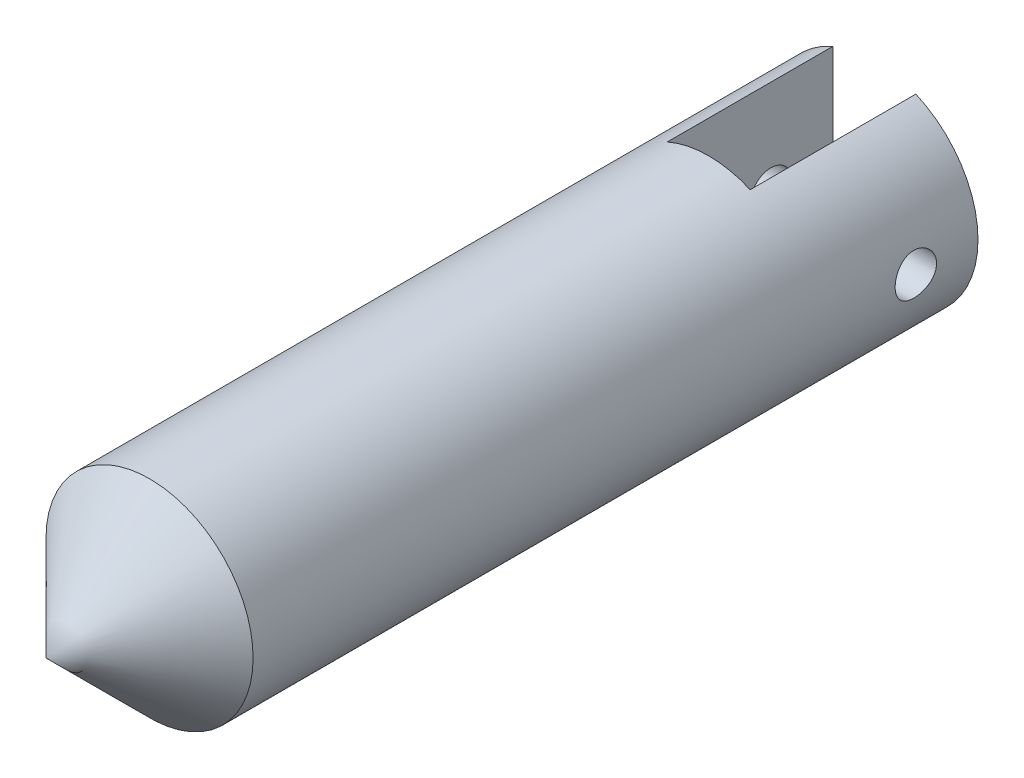
ISO-10303-21;
HEADER;
FILE_DESCRIPTION(('STEP AP214'),'2;1');
FILE_NAME('part.step','',(''),(''),'','','');
FILE_SCHEMA(('AUTOMOTIVE_DESIGN { 1 0 10303 214 1 1 1 1 }'));
ENDSEC;
DATA;
#1=APPLICATION_CONTEXT('core data for automotive mechanical design processes');
#2=APPLICATION_PROTOCOL_DEFINITION('international standard','automotive_design',2000,#1);
#3=PRODUCT_CONTEXT('',#1,'mechanical');
#4=PRODUCT('Part','Part','',(#3));
#5=PRODUCT_RELATED_PRODUCT_CATEGORY('part','',(#4));
#6=PRODUCT_DEFINITION_FORMATION('','',#4);
#7=PRODUCT_DEFINITION_CONTEXT('part definition',#1,'design');
#8=PRODUCT_DEFINITION('design','',#6,#7);
#9=PRODUCT_DEFINITION_SHAPE('','',#8);
#10=(LENGTH_UNIT() NAMED_UNIT(*) SI_UNIT(.MILLI.,.METRE.));
#11=(NAMED_UNIT(*) PLANE_ANGLE_UNIT() SI_UNIT($,.RADIAN.));
#12=(NAMED_UNIT(*) SI_UNIT($,.STERADIAN.) SOLID_ANGLE_UNIT());
#13=UNCERTAINTY_MEASURE_WITH_UNIT(LENGTH_MEASURE(1.E-05),#10,'distance_accuracy_value','');
#14=(GEOMETRIC_REPRESENTATION_CONTEXT(3) GLOBAL_UNCERTAINTY_ASSIGNED_CONTEXT((#13)) GLOBAL_UNIT_ASSIGNED_CONTEXT((#10,
#11,#12)) REPRESENTATION_CONTEXT('',''));
#15=CARTESIAN_POINT('',(0.,0.,0.));
#16=DIRECTION('',(0.,0.,1.));
#17=DIRECTION('',(1.,0.,0.));
#18=AXIS2_PLACEMENT_3D('',#15,#16,#17);
#19=CARTESIAN_POINT('',(0.,0.,0.));
#20=DIRECTION('',(0.,0.,1.));
#21=DIRECTION('',(1.,0.,0.));
#22=AXIS2_PLACEMENT_3D('',#19,#20,#21);
#23=PLANE('',#22);
#24=CARTESIAN_POINT('',(0.,0.,0.));
#25=DIRECTION('',(0.,0.,1.));
#26=DIRECTION('',(1.,0.,0.));
#27=AXIS2_PLACEMENT_3D('',#24,#25,#26);
#28=CIRCLE('',#27,6.35);
#29=CARTESIAN_POINT('',(-2.54,5.81987113259392,0.));
#30=VERTEX_POINT('',#29);
#31=CARTESIAN_POINT('',(-2.54,-5.81987113259392,0.));
#32=VERTEX_POINT('',#31);
#33=EDGE_CURVE('E93',#30,#32,#28,.T.);
#34=ORIENTED_EDGE('',*,*,#33,.F.);
#35=DIRECTION('',(0.,-1.,0.));
#36=VECTOR('',#35,1.);
#37=CARTESIAN_POINT('',(-2.54,0.,0.));
#38=LINE('',#37,#36);
#39=EDGE_CURVE('E82',#30,#32,#38,.T.);
#40=ORIENTED_EDGE('',*,*,#39,.T.);
#41=EDGE_LOOP('',(#34,#40));
#42=FACE_BOUND('',#41,.T.);
#43=ADVANCED_FACE('F33',(#42),#23,.F.);
#44=CARTESIAN_POINT('',(0.,0.,44.45));
#45=DIRECTION('',(0.,0.,-1.));
#46=DIRECTION('',(-1.,0.,0.));
#47=AXIS2_PLACEMENT_3D('',#44,#45,#46);
#48=CYLINDRICAL_SURFACE('',#47,6.35);
#49=CARTESIAN_POINT('',(6.35,0.,5.08));
#50=CARTESIAN_POINT('',(6.34999869927706,0.0705826716266442,5.0799974034871));
#51=CARTESIAN_POINT('',(6.34881109176353,0.141198168455934,5.07409596943109));
#52=CARTESIAN_POINT('',(6.34418804341504,0.280433154765055,5.05066490485364));
#53=CARTESIAN_POINT('',(6.34075081682436,0.349051013277522,5.03312603634208));
#54=CARTESIAN_POINT('',(6.33201234583424,0.482257487684408,4.9869835825016));
#55=CARTESIAN_POINT('',(6.32671288727432,0.546849894275081,4.95839059520725));
#56=CARTESIAN_POINT('',(6.31482605504849,0.670316145857567,4.89098304566066));
#57=CARTESIAN_POINT('',(6.30823875809348,0.729190331146282,4.85216909217885));
#58=CARTESIAN_POINT('',(6.29440149969062,0.840350716189879,4.76486411224988));
#59=CARTESIAN_POINT('',(6.28714446790521,0.892548317971326,4.71626138865317));
#60=CARTESIAN_POINT('',(6.27283709174787,0.988106680892196,4.61099863118254));
#61=CARTESIAN_POINT('',(6.26578676355538,1.03146675185844,4.5543379686044));
#62=CARTESIAN_POINT('',(6.25262201102021,1.10849632675148,4.43393043487492));
#63=CARTESIAN_POINT('',(6.24651668353481,1.14207409235965,4.37012379237862));
#64=CARTESIAN_POINT('',(6.23603360434191,1.19799819655699,4.23763208986482));
#65=CARTESIAN_POINT('',(6.23165568197691,1.22034564469529,4.16894751255014));
#66=CARTESIAN_POINT('',(6.225194626703,1.25288713085373,4.02960285783695));
#67=CARTESIAN_POINT('',(6.22308217036128,1.26323661240765,3.95898046893937));
#68=CARTESIAN_POINT('',(6.22130296326996,1.27197120221217,3.81697252686728));
#69=CARTESIAN_POINT('',(6.22163596244158,1.27035753384615,3.74558705247341));
#70=CARTESIAN_POINT('',(6.22468339958194,1.25533730783931,3.60521657921333));
#71=CARTESIAN_POINT('',(6.2273618513063,1.24210894610976,3.53621161485331));
#72=CARTESIAN_POINT('',(6.23474173623202,1.20451611347127,3.40142058263799));
#73=CARTESIAN_POINT('',(6.23944326604379,1.18015111073787,3.33563466867286));
#74=CARTESIAN_POINT('',(6.25037635495518,1.12080647526689,3.20863561763643));
#75=CARTESIAN_POINT('',(6.25661804063405,1.08575621206479,3.14745639294715));
#76=CARTESIAN_POINT('',(6.26992165841789,1.0060858397073,3.03178102053452));
#77=CARTESIAN_POINT('',(6.27698368474725,0.961464630733173,2.97728564199903));
#78=CARTESIAN_POINT('',(6.29128816976657,0.862964916891943,2.87549665887969));
#79=CARTESIAN_POINT('',(6.29853158897849,0.808934324739806,2.8283502388189));
#80=CARTESIAN_POINT('',(6.31226637867299,0.693654980558753,2.74376661519744));
#81=CARTESIAN_POINT('',(6.31875773950996,0.632406135971825,2.70632953615715));
#82=CARTESIAN_POINT('',(6.33027296504327,0.504265421336229,2.64220006328301));
#83=CARTESIAN_POINT('',(6.33529452837305,0.437364910873331,2.61552449507144));
#84=CARTESIAN_POINT('',(6.3432868941458,0.299909200089804,2.57383219797102));
#85=CARTESIAN_POINT('',(6.34625794500675,0.229354443592011,2.55881405676649));
#86=CARTESIAN_POINT('',(6.34977993270922,0.0878578451464809,2.54107130368127));
#87=CARTESIAN_POINT('',(6.35037051808637,0.0169422169734816,2.53814526718386));
#88=CARTESIAN_POINT('',(6.3491751595123,-0.124364666424747,2.54412732085657));
#89=CARTESIAN_POINT('',(6.34738934915636,-0.194755950903618,2.55303474577779));
#90=CARTESIAN_POINT('',(6.34166666650182,-0.332366188132107,2.58226353440082));
#91=CARTESIAN_POINT('',(6.33774928033342,-0.399607974391677,2.60248154699234));
#92=CARTESIAN_POINT('',(6.32820111117511,-0.529747006924578,2.65364465797288));
#93=CARTESIAN_POINT('',(6.32257019982068,-0.592643927279676,2.68459056003957));
#94=CARTESIAN_POINT('',(6.31012087647284,-0.713157290581497,2.75676676312717));
#95=CARTESIAN_POINT('',(6.30328877055056,-0.77069966097528,2.79811833191946));
#96=CARTESIAN_POINT('',(6.28922713233951,-0.878100884281393,2.88976967283325));
#97=CARTESIAN_POINT('',(6.28199755749853,-0.927958912342069,2.94007040432783));
#98=CARTESIAN_POINT('',(6.26782215517346,-1.0193535502832,3.04910915690173));
#99=CARTESIAN_POINT('',(6.26088232496296,-1.06075188210979,3.1079639951611));
#100=CARTESIAN_POINT('',(6.24819923581167,-1.13307548346503,3.23191042892298));
#101=CARTESIAN_POINT('',(6.24245592899945,-1.16400117202209,3.29700177475841));
#102=CARTESIAN_POINT('',(6.23286460542166,-1.21431283880909,3.43124567260993));
#103=CARTESIAN_POINT('',(6.22900678087677,-1.23375864473464,3.5003750683371));
#104=CARTESIAN_POINT('',(6.22360244725872,-1.26073998756654,3.64100548593345));
#105=CARTESIAN_POINT('',(6.22205563677712,-1.26827707764589,3.71250619728587));
#106=CARTESIAN_POINT('',(6.22146520031851,-1.27116955680169,3.85446125797128));
#107=CARTESIAN_POINT('',(6.22237667370412,-1.26674345085004,3.9249110591373));
#108=CARTESIAN_POINT('',(6.22649978325459,-1.24631742620708,4.06404019537938));
#109=CARTESIAN_POINT('',(6.22971140094305,-1.23031760048421,4.1327195446724));
#110=CARTESIAN_POINT('',(6.23805285558331,-1.18729578199367,4.26621919327549));
#111=CARTESIAN_POINT('',(6.24317802693915,-1.16030058353103,4.33104843783807));
#112=CARTESIAN_POINT('',(6.25477178017196,-1.09607939864404,4.45529172533274));
#113=CARTESIAN_POINT('',(6.26124047468595,-1.0588525543441,4.51470531363092));
#114=CARTESIAN_POINT('',(6.27492979864496,-0.974478511778746,4.6275187766309));
#115=CARTESIAN_POINT('',(6.28216133595318,-0.927173516788679,4.68079933188985));
#116=CARTESIAN_POINT('',(6.29648323977382,-0.824311748646689,4.77873848102205));
#117=CARTESIAN_POINT('',(6.30357357346244,-0.768753081684735,4.82339509070294));
#118=CARTESIAN_POINT('',(6.31690167132724,-0.650262388942073,4.90325999781199));
#119=CARTESIAN_POINT('',(6.32312973648443,-0.58725928322589,4.93836452416563));
#120=CARTESIAN_POINT('',(6.3339360885795,-0.45614127839473,4.99743237569767));
#121=CARTESIAN_POINT('',(6.33851586166042,-0.38803105129617,5.02140574270627));
#122=CARTESIAN_POINT('',(6.34461993196121,-0.2664732909332,5.05288797401679));
#123=CARTESIAN_POINT('',(6.34662565011234,-0.213717713297506,5.06303685600885));
#124=CARTESIAN_POINT('',(6.34931615757664,-0.107314397016785,5.07659374869512));
#125=CARTESIAN_POINT('',(6.35000098898907,-0.0536666868607461,5.0800019742274));
#126=CARTESIAN_POINT('',(6.35,0.,5.08));
#127=B_SPLINE_CURVE_WITH_KNOTS('',3,(#49,#50,#51,#52,#53,#54,#55,#56,#57,#58,#59,#60,#61,#62,
#63,#64,#65,#66,#67,#68,#69,#70,#71,#72,#73,#74,#75,#76,#77,#78,#79,#80,#81,#82,#83,#84,#85,#86,
#87,#88,#89,#90,#91,#92,#93,#94,#95,#96,#97,#98,#99,#100,#101,#102,#103,#104,#105,#106,#107,
#108,#109,#110,#111,#112,#113,#114,#115,#116,#117,#118,#119,#120,#121,#122,#123,#124,#125,#126),
.UNSPECIFIED.,.T.,.F.,(4,2,2,2,2,2,2,2,2,2,2,2,2,2,2,2,2,2,2,2,2,2,2,2,2,2,2,2,2,2,2,2,2,2,2,2,
2,2,4),(0.,0.211551685939798,0.423271506377981,0.634788843767935,0.846293585833197,
1.06036449104248,1.27445210786916,1.49048717657522,1.70650089693801,1.91968355081556,
2.13284440437156,2.34279093297974,2.55274748852237,2.76412312558563,2.97552306532082,
3.19072580664016,3.40593130775572,3.62147199064611,3.83698655636506,4.04889634308857,
4.26079421725492,4.47078676517419,4.68079504804349,4.89337433862366,5.10597643199331,
5.32181598295617,5.53764689678803,5.75234283911559,5.96701077779627,6.17778447660981,
6.38855648235613,6.5988179079145,6.80909696828971,7.02294856823712,7.23684931256822,
7.4529886077806,7.66893253507249,7.82978844618166,7.99063923041166),.UNSPECIFIED.);
#128=CARTESIAN_POINT('',(6.35,0.,5.08));
#129=VERTEX_POINT('',#128);
#130=EDGE_CURVE('E112',#129,#129,#127,.T.);
#131=ORIENTED_EDGE('',*,*,#130,.T.);
#132=EDGE_LOOP('',(#131));
#133=FACE_BOUND('',#132,.T.);
#134=CARTESIAN_POINT('',(-6.35,0.,5.08));
#135=CARTESIAN_POINT('',(-6.34999869927706,-0.0705826716266443,5.0799974034871));
#136=CARTESIAN_POINT('',(-6.34881109176353,-0.141198168455934,5.07409596943109));
#137=CARTESIAN_POINT('',(-6.34418804341504,-0.280433154765055,5.05066490485364));
#138=CARTESIAN_POINT('',(-6.34075081682436,-0.349051013277522,5.03312603634208));
#139=CARTESIAN_POINT('',(-6.33201234583424,-0.482257487684408,4.9869835825016));
#140=CARTESIAN_POINT('',(-6.32671288727432,-0.546849894275081,4.95839059520725));
#141=CARTESIAN_POINT('',(-6.31482605504849,-0.670316145857567,4.89098304566066));
#142=CARTESIAN_POINT('',(-6.30823875809348,-0.729190331146282,4.85216909217885));
#143=CARTESIAN_POINT('',(-6.29440149969062,-0.84035071618988,4.76486411224988));
#144=CARTESIAN_POINT('',(-6.28714446790521,-0.892548317971327,4.71626138865317));
#145=CARTESIAN_POINT('',(-6.27283709174787,-0.988106680892197,4.61099863118254));
#146=CARTESIAN_POINT('',(-6.26578676355538,-1.03146675185844,4.5543379686044));
#147=CARTESIAN_POINT('',(-6.25262201102021,-1.10849632675148,4.43393043487492));
#148=CARTESIAN_POINT('',(-6.24651668353481,-1.14207409235965,4.37012379237862));
#149=CARTESIAN_POINT('',(-6.2360336043419,-1.19799819655699,4.23763208986482));
#150=CARTESIAN_POINT('',(-6.23165568197691,-1.22034564469529,4.16894751255014));
#151=CARTESIAN_POINT('',(-6.225194626703,-1.25288713085373,4.02960285783694));
#152=CARTESIAN_POINT('',(-6.22308217036128,-1.26323661240765,3.95898046893937));
#153=CARTESIAN_POINT('',(-6.22130296326997,-1.27197120221217,3.81697252686728));
#154=CARTESIAN_POINT('',(-6.22163596244158,-1.27035753384615,3.74558705247341));
#155=CARTESIAN_POINT('',(-6.22468339958194,-1.25533730783931,3.60521657921332));
#156=CARTESIAN_POINT('',(-6.2273618513063,-1.24210894610976,3.53621161485331));
#157=CARTESIAN_POINT('',(-6.23474173623201,-1.20451611347127,3.40142058263799));
#158=CARTESIAN_POINT('',(-6.23944326604379,-1.18015111073787,3.33563466867286));
#159=CARTESIAN_POINT('',(-6.25037635495518,-1.12080647526689,3.20863561763643));
#160=CARTESIAN_POINT('',(-6.25661804063405,-1.08575621206479,3.14745639294715));
#161=CARTESIAN_POINT('',(-6.26992165841789,-1.0060858397073,3.03178102053453));
#162=CARTESIAN_POINT('',(-6.27698368474725,-0.961464630733173,2.97728564199903));
#163=CARTESIAN_POINT('',(-6.29128816976656,-0.862964916891943,2.87549665887969));
#164=CARTESIAN_POINT('',(-6.29853158897849,-0.808934324739805,2.8283502388189));
#165=CARTESIAN_POINT('',(-6.31226637867299,-0.693654980558753,2.74376661519744));
#166=CARTESIAN_POINT('',(-6.31875773950996,-0.632406135971825,2.70632953615715));
#167=CARTESIAN_POINT('',(-6.33027296504327,-0.50426542133623,2.64220006328301));
#168=CARTESIAN_POINT('',(-6.33529452837305,-0.437364910873332,2.61552449507144));
#169=CARTESIAN_POINT('',(-6.3432868941458,-0.299909200089805,2.57383219797102));
#170=CARTESIAN_POINT('',(-6.34625794500675,-0.229354443592011,2.55881405676649));
#171=CARTESIAN_POINT('',(-6.34977993270922,-0.0878578451464811,2.54107130368127));
#172=CARTESIAN_POINT('',(-6.35037051808637,-0.0169422169734818,2.53814526718386));
#173=CARTESIAN_POINT('',(-6.3491751595123,0.124364666424747,2.54412732085657));
#174=CARTESIAN_POINT('',(-6.34738934915636,0.194755950903618,2.55303474577779));
#175=CARTESIAN_POINT('',(-6.34166666650182,0.332366188132107,2.58226353440082));
#176=CARTESIAN_POINT('',(-6.33774928033342,0.399607974391677,2.60248154699234));
#177=CARTESIAN_POINT('',(-6.32820111117511,0.529747006924578,2.65364465797288));
#178=CARTESIAN_POINT('',(-6.32257019982068,0.592643927279676,2.68459056003957));
#179=CARTESIAN_POINT('',(-6.31012087647284,0.713157290581497,2.75676676312717));
#180=CARTESIAN_POINT('',(-6.30328877055056,0.77069966097528,2.79811833191946));
#181=CARTESIAN_POINT('',(-6.28922713233951,0.878100884281394,2.88976967283325));
#182=CARTESIAN_POINT('',(-6.28199755749853,0.927958912342069,2.94007040432783));
#183=CARTESIAN_POINT('',(-6.26782215517346,1.0193535502832,3.04910915690173));
#184=CARTESIAN_POINT('',(-6.26088232496296,1.06075188210979,3.1079639951611));
#185=CARTESIAN_POINT('',(-6.24819923581167,1.13307548346503,3.23191042892298));
#186=CARTESIAN_POINT('',(-6.24245592899945,1.16400117202209,3.29700177475841));
#187=CARTESIAN_POINT('',(-6.23286460542166,1.21431283880909,3.43124567260993));
#188=CARTESIAN_POINT('',(-6.22900678087677,1.23375864473464,3.5003750683371));
#189=CARTESIAN_POINT('',(-6.22360244725872,1.26073998756654,3.64100548593345));
#190=CARTESIAN_POINT('',(-6.22205563677711,1.26827707764589,3.71250619728587));
#191=CARTESIAN_POINT('',(-6.22146520031851,1.27116955680169,3.85446125797128));
#192=CARTESIAN_POINT('',(-6.22237667370412,1.26674345085004,3.9249110591373));
#193=CARTESIAN_POINT('',(-6.2264997832546,1.24631742620708,4.06404019537938));
#194=CARTESIAN_POINT('',(-6.22971140094305,1.23031760048421,4.1327195446724));
#195=CARTESIAN_POINT('',(-6.23805285558331,1.18729578199367,4.26621919327549));
#196=CARTESIAN_POINT('',(-6.24317802693915,1.16030058353103,4.33104843783807));
#197=CARTESIAN_POINT('',(-6.25477178017196,1.09607939864404,4.45529172533274));
#198=CARTESIAN_POINT('',(-6.26124047468595,1.0588525543441,4.51470531363092));
#199=CARTESIAN_POINT('',(-6.27492979864496,0.974478511778747,4.6275187766309));
#200=CARTESIAN_POINT('',(-6.28216133595318,0.92717351678868,4.68079933188985));
#201=CARTESIAN_POINT('',(-6.29648323977382,0.824311748646689,4.77873848102205));
#202=CARTESIAN_POINT('',(-6.30357357346244,0.768753081684736,4.82339509070294));
#203=CARTESIAN_POINT('',(-6.31690167132724,0.650262388942074,4.90325999781199));
#204=CARTESIAN_POINT('',(-6.32312973648443,0.587259283225891,4.93836452416563));
#205=CARTESIAN_POINT('',(-6.3339360885795,0.456141278394731,4.99743237569767));
#206=CARTESIAN_POINT('',(-6.33851586166042,0.388031051296171,5.02140574270627));
#207=CARTESIAN_POINT('',(-6.34461993196121,0.266473290933201,5.05288797401679));
#208=CARTESIAN_POINT('',(-6.34662565011234,0.213717713297507,5.06303685600885));
#209=CARTESIAN_POINT('',(-6.34931615757664,0.107314397016786,5.07659374869512));
#210=CARTESIAN_POINT('',(-6.35000098898906,0.0536666868607465,5.08000197422741));
#211=CARTESIAN_POINT('',(-6.35,0.,5.08));
#212=B_SPLINE_CURVE_WITH_KNOTS('',3,(#134,#135,#136,#137,#138,#139,#140,#141,#142,#143,#144,
#145,#146,#147,#148,#149,#150,#151,#152,#153,#154,#155,#156,#157,#158,#159,#160,#161,#162,#163,
#164,#165,#166,#167,#168,#169,#170,#171,#172,#173,#174,#175,#176,#177,#178,#179,#180,#181,#182,
#183,#184,#185,#186,#187,#188,#189,#190,#191,#192,#193,#194,#195,#196,#197,#198,#199,#200,#201,
#202,#203,#204,#205,#206,#207,#208,#209,#210,#211),.UNSPECIFIED.,.T.,.F.,(4,2,2,2,2,2,2,2,2,2,2,
2,2,2,2,2,2,2,2,2,2,2,2,2,2,2,2,2,2,2,2,2,2,2,2,2,2,2,4),(0.,0.211551685939799,
0.423271506377981,0.634788843767935,0.846293585833197,1.06036449104248,1.27445210786916,
1.49048717657522,1.70650089693801,1.91968355081556,2.13284440437156,2.34279093297974,
2.55274748852237,2.76412312558563,2.97552306532082,3.19072580664015,3.40593130775572,
3.6214719906461,3.83698655636506,4.04889634308857,4.26079421725492,4.47078676517419,
4.68079504804349,4.89337433862366,5.10597643199331,5.32181598295617,5.53764689678803,
5.75234283911559,5.96701077779627,6.17778447660981,6.38855648235613,6.5988179079145,
6.80909696828971,7.02294856823712,7.23684931256822,7.4529886077806,7.66893253507249,
7.82978844618166,7.99063923041166),.UNSPECIFIED.);
#213=CARTESIAN_POINT('',(-6.35,0.,5.08));
#214=VERTEX_POINT('',#213);
#215=EDGE_CURVE('E116',#214,#214,#212,.T.);
#216=ORIENTED_EDGE('',*,*,#215,.T.);
#217=EDGE_LOOP('',(#216));
#218=FACE_BOUND('',#217,.T.);
#219=CARTESIAN_POINT('',(0.,0.,10.16));
#220=DIRECTION('',(0.,0.,1.));
#221=DIRECTION('',(1.,0.,0.));
#222=AXIS2_PLACEMENT_3D('',#219,#220,#221);
#223=CIRCLE('',#222,6.35);
#224=CARTESIAN_POINT('',(2.54,5.81987113259392,10.16));
#225=VERTEX_POINT('',#224);
#226=CARTESIAN_POINT('',(-2.54,5.81987113259392,10.16));
#227=VERTEX_POINT('',#226);
#228=EDGE_CURVE('E11',#225,#227,#223,.T.);
#229=ORIENTED_EDGE('',*,*,#228,.T.);
#230=DIRECTION('',(0.,0.,-1.));
#231=VECTOR('',#230,1.);
#232=CARTESIAN_POINT('',(-2.54,5.81987113259392,44.45));
#233=LINE('',#232,#231);
#234=EDGE_CURVE('E94',#227,#30,#233,.T.);
#235=ORIENTED_EDGE('',*,*,#234,.T.);
#236=ORIENTED_EDGE('',*,*,#33,.T.);
#237=DIRECTION('',(0.,0.,-1.));
#238=VECTOR('',#237,1.);
#239=CARTESIAN_POINT('',(-2.54,-5.81987113259392,44.45));
#240=LINE('',#239,#238);
#241=CARTESIAN_POINT('',(-2.54,-5.81987113259392,10.16));
#242=VERTEX_POINT('',#241);
#243=EDGE_CURVE('E90',#32,#242,#240,.F.);
#244=ORIENTED_EDGE('',*,*,#243,.T.);
#245=CARTESIAN_POINT('',(2.54,-5.81987113259392,10.16));
#246=VERTEX_POINT('',#245);
#247=EDGE_CURVE('E43',#242,#246,#223,.T.);
#248=ORIENTED_EDGE('',*,*,#247,.T.);
#249=DIRECTION('',(0.,0.,-1.));
#250=VECTOR('',#249,1.);
#251=CARTESIAN_POINT('',(2.54,-5.81987113259392,44.45));
#252=LINE('',#251,#250);
#253=CARTESIAN_POINT('',(2.54,-5.81987113259392,0.));
#254=VERTEX_POINT('',#253);
#255=EDGE_CURVE('E77',#246,#254,#252,.T.);
#256=ORIENTED_EDGE('',*,*,#255,.T.);
#257=CARTESIAN_POINT('',(2.54,5.81987113259392,0.));
#258=VERTEX_POINT('',#257);
#259=EDGE_CURVE('E88',#254,#258,#28,.T.);
#260=ORIENTED_EDGE('',*,*,#259,.T.);
#261=DIRECTION('',(0.,0.,-1.));
#262=VECTOR('',#261,1.);
#263=CARTESIAN_POINT('',(2.54,5.81987113259392,44.45));
#264=LINE('',#263,#262);
#265=EDGE_CURVE('E50',#258,#225,#264,.F.);
#266=ORIENTED_EDGE('',*,*,#265,.T.);
#267=EDGE_LOOP('',(#229,#235,#236,#244,#248,#256,#260,#266));
#268=FACE_BOUND('',#267,.T.);
#269=CARTESIAN_POINT('',(0.,0.,44.45));
#270=DIRECTION('',(0.,0.,1.));
#271=DIRECTION('',(1.,0.,0.));
#272=AXIS2_PLACEMENT_3D('',#269,#270,#271);
#273=CIRCLE('',#272,6.35);
#274=CARTESIAN_POINT('',(6.35,0.,44.45));
#275=VERTEX_POINT('',#274);
#276=EDGE_CURVE('E83',#275,#275,#273,.T.);
#277=ORIENTED_EDGE('',*,*,#276,.F.);
#278=EDGE_LOOP('',(#277));
#279=FACE_BOUND('',#278,.T.);
#280=ADVANCED_FACE('F35',(#133,#218,#268,#279),#48,.T.);
#281=ORIENTED_EDGE('',*,*,#259,.F.);
#282=DIRECTION('',(0.,1.,0.));
#283=VECTOR('',#282,1.);
#284=CARTESIAN_POINT('',(2.54,0.,0.));
#285=LINE('',#284,#283);
#286=EDGE_CURVE('E74',#254,#258,#285,.T.);
#287=ORIENTED_EDGE('',*,*,#286,.T.);
#288=EDGE_LOOP('',(#281,#287));
#289=FACE_BOUND('',#288,.T.);
#290=ADVANCED_FACE('F92',(#289),#23,.F.);
#291=CARTESIAN_POINT('',(0.,0.,44.45));
#292=DIRECTION('',(0.,0.,-1.));
#293=DIRECTION('',(-1.,0.,0.));
#294=AXIS2_PLACEMENT_3D('',#291,#292,#293);
#295=CONICAL_SURFACE('',#294,6.35,0.785398163397448);
#296=CARTESIAN_POINT('',(0.,0.,50.8));
#297=VERTEX_POINT('',#296);
#298=VERTEX_LOOP('',#297);
#299=FACE_BOUND('',#298,.T.);
#300=ORIENTED_EDGE('',*,*,#276,.T.);
#301=EDGE_LOOP('',(#300));
#302=FACE_BOUND('',#301,.T.);
#303=ADVANCED_FACE('F136',(#299,#302),#295,.T.);
#304=CARTESIAN_POINT('',(-2.54,6.35,10.16));
#305=DIRECTION('',(0.,0.,1.));
#306=DIRECTION('',(1.,0.,0.));
#307=AXIS2_PLACEMENT_3D('',#304,#305,#306);
#308=PLANE('',#307);
#309=DIRECTION('',(0.,-1.,0.));
#310=VECTOR('',#309,1.);
#311=CARTESIAN_POINT('',(2.54,-6.35,10.16));
#312=LINE('',#311,#310);
#313=EDGE_CURVE('E111',#225,#246,#312,.T.);
#314=ORIENTED_EDGE('',*,*,#313,.T.);
#315=ORIENTED_EDGE('',*,*,#247,.F.);
#316=DIRECTION('',(0.,1.,0.));
#317=VECTOR('',#316,1.);
#318=CARTESIAN_POINT('',(-2.54,-6.35,10.16));
#319=LINE('',#318,#317);
#320=EDGE_CURVE('E108',#242,#227,#319,.T.);
#321=ORIENTED_EDGE('',*,*,#320,.T.);
#322=ORIENTED_EDGE('',*,*,#228,.F.);
#323=EDGE_LOOP('',(#314,#315,#321,#322));
#324=FACE_BOUND('',#323,.T.);
#325=ADVANCED_FACE('F110',(#324),#308,.F.);
#326=CARTESIAN_POINT('',(-2.54,-6.35,10.16));
#327=DIRECTION('',(-1.,0.,0.));
#328=DIRECTION('',(0.,0.,1.));
#329=AXIS2_PLACEMENT_3D('',#326,#327,#328);
#330=PLANE('',#329);
#331=CARTESIAN_POINT('',(-2.54,0.,3.81));
#332=DIRECTION('',(-1.,0.,0.));
#333=DIRECTION('',(0.,0.,1.));
#334=AXIS2_PLACEMENT_3D('',#331,#332,#333);
#335=CIRCLE('',#334,1.27);
#336=CARTESIAN_POINT('',(-2.54,0.,5.08));
#337=VERTEX_POINT('',#336);
#338=EDGE_CURVE('E194',#337,#337,#335,.T.);
#339=ORIENTED_EDGE('',*,*,#338,.T.);
#340=EDGE_LOOP('',(#339));
#341=FACE_BOUND('',#340,.T.);
#342=ORIENTED_EDGE('',*,*,#320,.F.);
#343=ORIENTED_EDGE('',*,*,#243,.F.);
#344=ORIENTED_EDGE('',*,*,#39,.F.);
#345=ORIENTED_EDGE('',*,*,#234,.F.);
#346=EDGE_LOOP('',(#342,#343,#344,#345));
#347=FACE_BOUND('',#346,.T.);
#348=ADVANCED_FACE('F107',(#341,#347),#330,.F.);
#349=CARTESIAN_POINT('',(2.54,-6.35,10.16));
#350=DIRECTION('',(1.,0.,0.));
#351=DIRECTION('',(0.,0.,-1.));
#352=AXIS2_PLACEMENT_3D('',#349,#350,#351);
#353=PLANE('',#352);
#354=CARTESIAN_POINT('',(2.54,0.,3.81));
#355=DIRECTION('',(1.,0.,0.));
#356=DIRECTION('',(0.,0.,-1.));
#357=AXIS2_PLACEMENT_3D('',#354,#355,#356);
#358=CIRCLE('',#357,1.27);
#359=CARTESIAN_POINT('',(2.54,0.,2.54));
#360=VERTEX_POINT('',#359);
#361=EDGE_CURVE('E38',#360,#360,#358,.T.);
#362=ORIENTED_EDGE('',*,*,#361,.T.);
#363=EDGE_LOOP('',(#362));
#364=FACE_BOUND('',#363,.T.);
#365=ORIENTED_EDGE('',*,*,#313,.F.);
#366=ORIENTED_EDGE('',*,*,#265,.F.);
#367=ORIENTED_EDGE('',*,*,#286,.F.);
#368=ORIENTED_EDGE('',*,*,#255,.F.);
#369=EDGE_LOOP('',(#365,#366,#367,#368));
#370=FACE_BOUND('',#369,.T.);
#371=ADVANCED_FACE('F76',(#364,#370),#353,.F.);
#372=CARTESIAN_POINT('',(6.35,0.,3.81));
#373=DIRECTION('',(-1.,0.,0.));
#374=DIRECTION('',(0.,0.,1.));
#375=AXIS2_PLACEMENT_3D('',#372,#373,#374);
#376=CYLINDRICAL_SURFACE('',#375,1.27);
#377=ORIENTED_EDGE('',*,*,#361,.F.);
#378=EDGE_LOOP('',(#377));
#379=FACE_BOUND('',#378,.T.);
#380=ORIENTED_EDGE('',*,*,#130,.F.);
#381=EDGE_LOOP('',(#380));
#382=FACE_BOUND('',#381,.T.);
#383=ADVANCED_FACE('F127',(#379,#382),#376,.F.);
#384=ORIENTED_EDGE('',*,*,#338,.F.);
#385=EDGE_LOOP('',(#384));
#386=FACE_BOUND('',#385,.T.);
#387=ORIENTED_EDGE('',*,*,#215,.F.);
#388=EDGE_LOOP('',(#387));
#389=FACE_BOUND('',#388,.T.);
#390=ADVANCED_FACE('F131',(#386,#389),#376,.F.);
#391=CLOSED_SHELL('',(#43,#280,#290,#303,#325,#348,#371,#383,#390));
#392=MANIFOLD_SOLID_BREP('B2',#391);
#393=ADVANCED_BREP_SHAPE_REPRESENTATION('',(#18,#392),#14);
#394=SHAPE_DEFINITION_REPRESENTATION(#9,#393);
ENDSEC;
END-ISO-10303-21;
